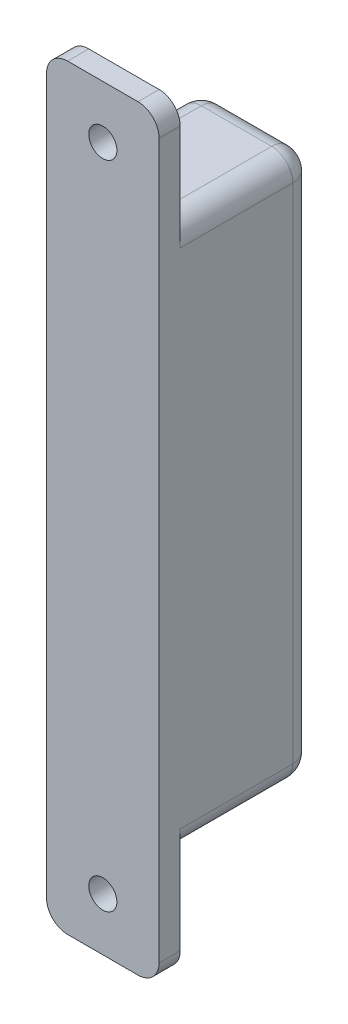
ISO-10303-21;
HEADER;
FILE_DESCRIPTION(('STEP AP214'),'2;1');
FILE_NAME('part.step','',(''),(''),'','','');
FILE_SCHEMA(('AUTOMOTIVE_DESIGN { 1 0 10303 214 1 1 1 1 }'));
ENDSEC;
DATA;
#1=APPLICATION_CONTEXT('core data for automotive mechanical design processes');
#2=APPLICATION_PROTOCOL_DEFINITION('international standard','automotive_design',2000,#1);
#3=PRODUCT_CONTEXT('',#1,'mechanical');
#4=PRODUCT('Part','Part','',(#3));
#5=PRODUCT_RELATED_PRODUCT_CATEGORY('part','',(#4));
#6=PRODUCT_DEFINITION_FORMATION('','',#4);
#7=PRODUCT_DEFINITION_CONTEXT('part definition',#1,'design');
#8=PRODUCT_DEFINITION('design','',#6,#7);
#9=PRODUCT_DEFINITION_SHAPE('','',#8);
#10=(LENGTH_UNIT() NAMED_UNIT(*) SI_UNIT(.MILLI.,.METRE.));
#11=(NAMED_UNIT(*) PLANE_ANGLE_UNIT() SI_UNIT($,.RADIAN.));
#12=(NAMED_UNIT(*) SI_UNIT($,.STERADIAN.) SOLID_ANGLE_UNIT());
#13=UNCERTAINTY_MEASURE_WITH_UNIT(LENGTH_MEASURE(1.E-05),#10,'distance_accuracy_value','');
#14=(GEOMETRIC_REPRESENTATION_CONTEXT(3) GLOBAL_UNCERTAINTY_ASSIGNED_CONTEXT((#13)) GLOBAL_UNIT_ASSIGNED_CONTEXT((#10,
#11,#12)) REPRESENTATION_CONTEXT('',''));
#15=CARTESIAN_POINT('',(0.,0.,0.));
#16=DIRECTION('',(0.,0.,1.));
#17=DIRECTION('',(1.,0.,0.));
#18=AXIS2_PLACEMENT_3D('',#15,#16,#17);
#19=CARTESIAN_POINT('',(0.,0.,3.));
#20=DIRECTION('',(0.,0.,-1.));
#21=DIRECTION('',(-1.,0.,0.));
#22=AXIS2_PLACEMENT_3D('',#19,#20,#21);
#23=PLANE('',#22);
#24=DIRECTION('',(0.,-1.,0.));
#25=VECTOR('',#24,1.);
#26=CARTESIAN_POINT('',(0.,-15.,3.));
#27=LINE('',#26,#25);
#28=CARTESIAN_POINT('',(0.,89.5,3.));
#29=VERTEX_POINT('',#28);
#30=CARTESIAN_POINT('',(0.,-12.,3.));
#31=VERTEX_POINT('',#30);
#32=EDGE_CURVE('E310',#29,#31,#27,.T.);
#33=ORIENTED_EDGE('',*,*,#32,.T.);
#34=CARTESIAN_POINT('',(3.,-12.,3.));
#35=DIRECTION('',(0.,0.,-1.));
#36=DIRECTION('',(-1.,0.,0.));
#37=AXIS2_PLACEMENT_3D('',#34,#35,#36);
#38=CIRCLE('',#37,3.);
#39=CARTESIAN_POINT('',(3.,-15.,3.));
#40=VERTEX_POINT('',#39);
#41=EDGE_CURVE('E284',#31,#40,#38,.F.);
#42=ORIENTED_EDGE('',*,*,#41,.T.);
#43=DIRECTION('',(1.,0.,0.));
#44=VECTOR('',#43,1.);
#45=CARTESIAN_POINT('',(16.,-15.,3.));
#46=LINE('',#45,#44);
#47=CARTESIAN_POINT('',(13.,-15.,3.));
#48=VERTEX_POINT('',#47);
#49=EDGE_CURVE('E320',#40,#48,#46,.T.);
#50=ORIENTED_EDGE('',*,*,#49,.T.);
#51=CARTESIAN_POINT('',(13.,-12.,3.));
#52=DIRECTION('',(0.,0.,-1.));
#53=DIRECTION('',(-1.,0.,0.));
#54=AXIS2_PLACEMENT_3D('',#51,#52,#53);
#55=CIRCLE('',#54,3.);
#56=CARTESIAN_POINT('',(16.,-12.,3.));
#57=VERTEX_POINT('',#56);
#58=EDGE_CURVE('E282',#48,#57,#55,.F.);
#59=ORIENTED_EDGE('',*,*,#58,.T.);
#60=DIRECTION('',(0.,1.,0.));
#61=VECTOR('',#60,1.);
#62=CARTESIAN_POINT('',(16.,0.,3.));
#63=LINE('',#62,#61);
#64=CARTESIAN_POINT('',(16.,89.5,3.));
#65=VERTEX_POINT('',#64);
#66=EDGE_CURVE('E315',#57,#65,#63,.T.);
#67=ORIENTED_EDGE('',*,*,#66,.T.);
#68=CARTESIAN_POINT('',(13.,89.5,3.));
#69=DIRECTION('',(0.,0.,-1.));
#70=DIRECTION('',(-1.,0.,0.));
#71=AXIS2_PLACEMENT_3D('',#68,#69,#70);
#72=CIRCLE('',#71,3.);
#73=CARTESIAN_POINT('',(13.,92.5,3.));
#74=VERTEX_POINT('',#73);
#75=EDGE_CURVE('E278',#65,#74,#72,.F.);
#76=ORIENTED_EDGE('',*,*,#75,.T.);
#77=DIRECTION('',(-1.,0.,0.));
#78=VECTOR('',#77,1.);
#79=CARTESIAN_POINT('',(0.,92.5,3.));
#80=LINE('',#79,#78);
#81=CARTESIAN_POINT('',(3.,92.5,3.));
#82=VERTEX_POINT('',#81);
#83=EDGE_CURVE('E298',#74,#82,#80,.T.);
#84=ORIENTED_EDGE('',*,*,#83,.T.);
#85=CARTESIAN_POINT('',(3.,89.5,3.));
#86=DIRECTION('',(0.,0.,-1.));
#87=DIRECTION('',(-1.,0.,0.));
#88=AXIS2_PLACEMENT_3D('',#85,#86,#87);
#89=CIRCLE('',#88,3.);
#90=EDGE_CURVE('E280',#82,#29,#89,.F.);
#91=ORIENTED_EDGE('',*,*,#90,.T.);
#92=EDGE_LOOP('',(#33,#42,#50,#59,#67,#76,#84,#91));
#93=FACE_BOUND('',#92,.T.);
#94=CARTESIAN_POINT('',(7.99999999999984,-7.49999999999999,3.));
#95=DIRECTION('',(0.,0.,-1.));
#96=DIRECTION('',(-1.,0.,0.));
#97=AXIS2_PLACEMENT_3D('',#94,#95,#96);
#98=CIRCLE('',#97,2.);
#99=CARTESIAN_POINT('',(5.99999999999985,-7.49999999999999,3.));
#100=VERTEX_POINT('',#99);
#101=EDGE_CURVE('E265',#100,#100,#98,.T.);
#102=ORIENTED_EDGE('',*,*,#101,.T.);
#103=EDGE_LOOP('',(#102));
#104=FACE_BOUND('',#103,.T.);
#105=CARTESIAN_POINT('',(8.,85.,3.));
#106=DIRECTION('',(0.,0.,1.));
#107=DIRECTION('',(1.,0.,0.));
#108=AXIS2_PLACEMENT_3D('',#105,#106,#107);
#109=CIRCLE('',#108,2.);
#110=CARTESIAN_POINT('',(10.,85.,3.));
#111=VERTEX_POINT('',#110);
#112=EDGE_CURVE('E334',#111,#111,#109,.T.);
#113=ORIENTED_EDGE('',*,*,#112,.F.);
#114=EDGE_LOOP('',(#113));
#115=FACE_BOUND('',#114,.T.);
#116=ADVANCED_FACE('F33',(#93,#104,#115),#23,.F.);
#117=CARTESIAN_POINT('',(16.,0.,-19.));
#118=DIRECTION('',(0.,-1.,0.));
#119=DIRECTION('',(0.,0.,-1.));
#120=AXIS2_PLACEMENT_3D('',#117,#118,#119);
#121=PLANE('',#120);
#122=DIRECTION('',(1.,0.,0.));
#123=VECTOR('',#122,1.);
#124=CARTESIAN_POINT('',(16.,0.,0.));
#125=LINE('',#124,#123);
#126=CARTESIAN_POINT('',(3.,0.,0.));
#127=VERTEX_POINT('',#126);
#128=CARTESIAN_POINT('',(13.,0.,0.));
#129=VERTEX_POINT('',#128);
#130=EDGE_CURVE('E198',#127,#129,#125,.T.);
#131=ORIENTED_EDGE('',*,*,#130,.F.);
#132=DIRECTION('',(0.,0.,1.));
#133=VECTOR('',#132,1.);
#134=CARTESIAN_POINT('',(3.,0.,-19.));
#135=LINE('',#134,#133);
#136=CARTESIAN_POINT('',(3.,0.,-16.));
#137=VERTEX_POINT('',#136);
#138=EDGE_CURVE('E208',#127,#137,#135,.F.);
#139=ORIENTED_EDGE('',*,*,#138,.T.);
#140=DIRECTION('',(1.,0.,0.));
#141=VECTOR('',#140,1.);
#142=CARTESIAN_POINT('',(16.,0.,-16.));
#143=LINE('',#142,#141);
#144=CARTESIAN_POINT('',(13.,0.,-16.));
#145=VERTEX_POINT('',#144);
#146=EDGE_CURVE('E204',#137,#145,#143,.T.);
#147=ORIENTED_EDGE('',*,*,#146,.T.);
#148=DIRECTION('',(0.,0.,1.));
#149=VECTOR('',#148,1.);
#150=CARTESIAN_POINT('',(13.,0.,-19.));
#151=LINE('',#150,#149);
#152=EDGE_CURVE('E206',#145,#129,#151,.T.);
#153=ORIENTED_EDGE('',*,*,#152,.T.);
#154=EDGE_LOOP('',(#131,#139,#147,#153));
#155=FACE_BOUND('',#154,.T.);
#156=ADVANCED_FACE('F382',(#155),#121,.T.);
#157=CARTESIAN_POINT('',(0.,0.,-19.));
#158=DIRECTION('',(-1.,0.,0.));
#159=DIRECTION('',(0.,0.,1.));
#160=AXIS2_PLACEMENT_3D('',#157,#158,#159);
#161=PLANE('',#160);
#162=DIRECTION('',(0.,-1.,0.));
#163=VECTOR('',#162,1.);
#164=CARTESIAN_POINT('',(0.,77.5,0.));
#165=LINE('',#164,#163);
#166=CARTESIAN_POINT('',(0.,3.,0.));
#167=VERTEX_POINT('',#166);
#168=CARTESIAN_POINT('',(0.,-12.,0.));
#169=VERTEX_POINT('',#168);
#170=EDGE_CURVE('E302',#167,#169,#165,.T.);
#171=ORIENTED_EDGE('',*,*,#170,.T.);
#172=DIRECTION('',(0.,0.,-1.));
#173=VECTOR('',#172,1.);
#174=CARTESIAN_POINT('',(0.,-12.,3.));
#175=LINE('',#174,#173);
#176=EDGE_CURVE('E276',#169,#31,#175,.F.);
#177=ORIENTED_EDGE('',*,*,#176,.T.);
#178=ORIENTED_EDGE('',*,*,#32,.F.);
#179=DIRECTION('',(0.,0.,-1.));
#180=VECTOR('',#179,1.);
#181=CARTESIAN_POINT('',(0.,89.5,0.));
#182=LINE('',#181,#180);
#183=CARTESIAN_POINT('',(0.,89.5,0.));
#184=VERTEX_POINT('',#183);
#185=EDGE_CURVE('E274',#29,#184,#182,.T.);
#186=ORIENTED_EDGE('',*,*,#185,.T.);
#187=CARTESIAN_POINT('',(0.,74.5,0.));
#188=VERTEX_POINT('',#187);
#189=EDGE_CURVE('E167',#184,#188,#165,.T.);
#190=ORIENTED_EDGE('',*,*,#189,.T.);
#191=DIRECTION('',(0.,0.,1.));
#192=VECTOR('',#191,1.);
#193=CARTESIAN_POINT('',(0.,74.5,-19.));
#194=LINE('',#193,#192);
#195=CARTESIAN_POINT('',(0.,74.5,-16.));
#196=VERTEX_POINT('',#195);
#197=EDGE_CURVE('E158',#188,#196,#194,.F.);
#198=ORIENTED_EDGE('',*,*,#197,.T.);
#199=DIRECTION('',(0.,-1.,0.));
#200=VECTOR('',#199,1.);
#201=CARTESIAN_POINT('',(0.,0.,-16.));
#202=LINE('',#201,#200);
#203=CARTESIAN_POINT('',(0.,3.,-16.));
#204=VERTEX_POINT('',#203);
#205=EDGE_CURVE('E164',#196,#204,#202,.T.);
#206=ORIENTED_EDGE('',*,*,#205,.T.);
#207=DIRECTION('',(0.,0.,1.));
#208=VECTOR('',#207,1.);
#209=CARTESIAN_POINT('',(0.,3.,-19.));
#210=LINE('',#209,#208);
#211=EDGE_CURVE('E171',#204,#167,#210,.T.);
#212=ORIENTED_EDGE('',*,*,#211,.T.);
#213=EDGE_LOOP('',(#171,#177,#178,#186,#190,#198,#206,#212));
#214=FACE_BOUND('',#213,.T.);
#215=ADVANCED_FACE('F161',(#214),#161,.T.);
#216=CARTESIAN_POINT('',(0.,77.5,-19.));
#217=DIRECTION('',(0.,1.,0.));
#218=DIRECTION('',(0.,0.,1.));
#219=AXIS2_PLACEMENT_3D('',#216,#217,#218);
#220=PLANE('',#219);
#221=DIRECTION('',(-1.,0.,0.));
#222=VECTOR('',#221,1.);
#223=CARTESIAN_POINT('',(0.,77.5,0.));
#224=LINE('',#223,#222);
#225=CARTESIAN_POINT('',(13.,77.5,0.));
#226=VERTEX_POINT('',#225);
#227=CARTESIAN_POINT('',(3.,77.5,0.));
#228=VERTEX_POINT('',#227);
#229=EDGE_CURVE('E195',#226,#228,#224,.T.);
#230=ORIENTED_EDGE('',*,*,#229,.F.);
#231=DIRECTION('',(0.,0.,1.));
#232=VECTOR('',#231,1.);
#233=CARTESIAN_POINT('',(13.,77.5,-19.));
#234=LINE('',#233,#232);
#235=CARTESIAN_POINT('',(13.,77.5,-16.));
#236=VERTEX_POINT('',#235);
#237=EDGE_CURVE('E220',#226,#236,#234,.F.);
#238=ORIENTED_EDGE('',*,*,#237,.T.);
#239=DIRECTION('',(-1.,0.,0.));
#240=VECTOR('',#239,1.);
#241=CARTESIAN_POINT('',(0.,77.5,-16.));
#242=LINE('',#241,#240);
#243=CARTESIAN_POINT('',(3.,77.5,-16.));
#244=VERTEX_POINT('',#243);
#245=EDGE_CURVE('E217',#236,#244,#242,.T.);
#246=ORIENTED_EDGE('',*,*,#245,.T.);
#247=DIRECTION('',(0.,0.,1.));
#248=VECTOR('',#247,1.);
#249=CARTESIAN_POINT('',(3.,77.5,-19.));
#250=LINE('',#249,#248);
#251=EDGE_CURVE('E178',#244,#228,#250,.T.);
#252=ORIENTED_EDGE('',*,*,#251,.T.);
#253=EDGE_LOOP('',(#230,#238,#246,#252));
#254=FACE_BOUND('',#253,.T.);
#255=ADVANCED_FACE('F409',(#254),#220,.T.);
#256=CARTESIAN_POINT('',(16.,77.5,-19.));
#257=DIRECTION('',(1.,0.,0.));
#258=DIRECTION('',(0.,0.,-1.));
#259=AXIS2_PLACEMENT_3D('',#256,#257,#258);
#260=PLANE('',#259);
#261=ORIENTED_EDGE('',*,*,#66,.F.);
#262=DIRECTION('',(0.,0.,-1.));
#263=VECTOR('',#262,1.);
#264=CARTESIAN_POINT('',(16.,-12.,0.));
#265=LINE('',#264,#263);
#266=CARTESIAN_POINT('',(16.,-12.,0.));
#267=VERTEX_POINT('',#266);
#268=EDGE_CURVE('E288',#57,#267,#265,.T.);
#269=ORIENTED_EDGE('',*,*,#268,.T.);
#270=DIRECTION('',(0.,1.,0.));
#271=VECTOR('',#270,1.);
#272=CARTESIAN_POINT('',(16.,92.5,0.));
#273=LINE('',#272,#271);
#274=CARTESIAN_POINT('',(16.,3.,0.));
#275=VERTEX_POINT('',#274);
#276=EDGE_CURVE('E303',#267,#275,#273,.T.);
#277=ORIENTED_EDGE('',*,*,#276,.T.);
#278=DIRECTION('',(0.,0.,1.));
#279=VECTOR('',#278,1.);
#280=CARTESIAN_POINT('',(16.,3.,-19.));
#281=LINE('',#280,#279);
#282=CARTESIAN_POINT('',(16.,3.,-16.));
#283=VERTEX_POINT('',#282);
#284=EDGE_CURVE('E215',#275,#283,#281,.F.);
#285=ORIENTED_EDGE('',*,*,#284,.T.);
#286=DIRECTION('',(0.,1.,0.));
#287=VECTOR('',#286,1.);
#288=CARTESIAN_POINT('',(16.,77.5,-16.));
#289=LINE('',#288,#287);
#290=CARTESIAN_POINT('',(16.,74.5,-16.));
#291=VERTEX_POINT('',#290);
#292=EDGE_CURVE('E210',#283,#291,#289,.T.);
#293=ORIENTED_EDGE('',*,*,#292,.T.);
#294=DIRECTION('',(0.,0.,1.));
#295=VECTOR('',#294,1.);
#296=CARTESIAN_POINT('',(16.,74.5,-19.));
#297=LINE('',#296,#295);
#298=CARTESIAN_POINT('',(16.,74.5,0.));
#299=VERTEX_POINT('',#298);
#300=EDGE_CURVE('E212',#291,#299,#297,.T.);
#301=ORIENTED_EDGE('',*,*,#300,.T.);
#302=CARTESIAN_POINT('',(16.,89.5,0.));
#303=VERTEX_POINT('',#302);
#304=EDGE_CURVE('E306',#299,#303,#273,.T.);
#305=ORIENTED_EDGE('',*,*,#304,.T.);
#306=DIRECTION('',(0.,0.,-1.));
#307=VECTOR('',#306,1.);
#308=CARTESIAN_POINT('',(16.,89.5,3.));
#309=LINE('',#308,#307);
#310=EDGE_CURVE('E286',#303,#65,#309,.F.);
#311=ORIENTED_EDGE('',*,*,#310,.T.);
#312=EDGE_LOOP('',(#261,#269,#277,#285,#293,#301,#305,#311));
#313=FACE_BOUND('',#312,.T.);
#314=ADVANCED_FACE('F351',(#313),#260,.T.);
#315=CARTESIAN_POINT('',(0.,0.,-19.));
#316=DIRECTION('',(0.,0.,-1.));
#317=DIRECTION('',(-1.,0.,0.));
#318=AXIS2_PLACEMENT_3D('',#315,#316,#317);
#319=PLANE('',#318);
#320=DIRECTION('',(-1.,0.,0.));
#321=VECTOR('',#320,1.);
#322=CARTESIAN_POINT('',(0.,74.5,-19.));
#323=LINE('',#322,#321);
#324=CARTESIAN_POINT('',(3.,74.5,-19.));
#325=VERTEX_POINT('',#324);
#326=CARTESIAN_POINT('',(13.,74.5,-19.));
#327=VERTEX_POINT('',#326);
#328=EDGE_CURVE('E224',#325,#327,#323,.F.);
#329=ORIENTED_EDGE('',*,*,#328,.T.);
#330=DIRECTION('',(0.,1.,0.));
#331=VECTOR('',#330,1.);
#332=CARTESIAN_POINT('',(13.,0.,-19.));
#333=LINE('',#332,#331);
#334=CARTESIAN_POINT('',(13.,3.,-19.));
#335=VERTEX_POINT('',#334);
#336=EDGE_CURVE('E229',#327,#335,#333,.F.);
#337=ORIENTED_EDGE('',*,*,#336,.T.);
#338=DIRECTION('',(1.,0.,0.));
#339=VECTOR('',#338,1.);
#340=CARTESIAN_POINT('',(0.,3.,-19.));
#341=LINE('',#340,#339);
#342=CARTESIAN_POINT('',(3.,3.,-19.));
#343=VERTEX_POINT('',#342);
#344=EDGE_CURVE('E226',#335,#343,#341,.F.);
#345=ORIENTED_EDGE('',*,*,#344,.T.);
#346=DIRECTION('',(0.,-1.,0.));
#347=VECTOR('',#346,1.);
#348=CARTESIAN_POINT('',(3.,0.,-19.));
#349=LINE('',#348,#347);
#350=EDGE_CURVE('E222',#343,#325,#349,.F.);
#351=ORIENTED_EDGE('',*,*,#350,.T.);
#352=EDGE_LOOP('',(#329,#337,#345,#351));
#353=FACE_BOUND('',#352,.T.);
#354=ADVANCED_FACE('F404',(#353),#319,.T.);
#355=CARTESIAN_POINT('',(0.,0.,0.));
#356=DIRECTION('',(0.,0.,-1.));
#357=DIRECTION('',(-1.,0.,0.));
#358=AXIS2_PLACEMENT_3D('',#355,#356,#357);
#359=PLANE('',#358);
#360=CARTESIAN_POINT('',(7.99999999999984,-7.49999999999999,0.));
#361=DIRECTION('',(0.,0.,-1.));
#362=DIRECTION('',(-1.,0.,0.));
#363=AXIS2_PLACEMENT_3D('',#360,#361,#362);
#364=CIRCLE('',#363,2.);
#365=CARTESIAN_POINT('',(5.99999999999985,-7.49999999999999,0.));
#366=VERTEX_POINT('',#365);
#367=EDGE_CURVE('E325',#366,#366,#364,.F.);
#368=ORIENTED_EDGE('',*,*,#367,.T.);
#369=EDGE_LOOP('',(#368));
#370=FACE_BOUND('',#369,.T.);
#371=DIRECTION('',(1.,0.,0.));
#372=VECTOR('',#371,1.);
#373=CARTESIAN_POINT('',(16.,-15.,0.));
#374=LINE('',#373,#372);
#375=CARTESIAN_POINT('',(3.,-15.,0.));
#376=VERTEX_POINT('',#375);
#377=CARTESIAN_POINT('',(13.,-15.,0.));
#378=VERTEX_POINT('',#377);
#379=EDGE_CURVE('E323',#376,#378,#374,.T.);
#380=ORIENTED_EDGE('',*,*,#379,.F.);
#381=CARTESIAN_POINT('',(3.,-12.,0.));
#382=DIRECTION('',(0.,0.,-1.));
#383=DIRECTION('',(-1.,0.,0.));
#384=AXIS2_PLACEMENT_3D('',#381,#382,#383);
#385=CIRCLE('',#384,3.);
#386=EDGE_CURVE('E272',#376,#169,#385,.T.);
#387=ORIENTED_EDGE('',*,*,#386,.T.);
#388=ORIENTED_EDGE('',*,*,#170,.F.);
#389=CARTESIAN_POINT('',(3.,3.,0.));
#390=DIRECTION('',(0.,0.,-1.));
#391=DIRECTION('',(-1.,0.,0.));
#392=AXIS2_PLACEMENT_3D('',#389,#390,#391);
#393=CIRCLE('',#392,3.);
#394=EDGE_CURVE('E231',#167,#127,#393,.F.);
#395=ORIENTED_EDGE('',*,*,#394,.T.);
#396=ORIENTED_EDGE('',*,*,#130,.T.);
#397=CARTESIAN_POINT('',(13.,3.,0.));
#398=DIRECTION('',(0.,0.,-1.));
#399=DIRECTION('',(-1.,0.,0.));
#400=AXIS2_PLACEMENT_3D('',#397,#398,#399);
#401=CIRCLE('',#400,3.);
#402=EDGE_CURVE('E233',#129,#275,#401,.F.);
#403=ORIENTED_EDGE('',*,*,#402,.T.);
#404=ORIENTED_EDGE('',*,*,#276,.F.);
#405=CARTESIAN_POINT('',(13.,-12.,0.));
#406=DIRECTION('',(0.,0.,-1.));
#407=DIRECTION('',(-1.,0.,0.));
#408=AXIS2_PLACEMENT_3D('',#405,#406,#407);
#409=CIRCLE('',#408,3.);
#410=EDGE_CURVE('E270',#267,#378,#409,.T.);
#411=ORIENTED_EDGE('',*,*,#410,.T.);
#412=EDGE_LOOP('',(#380,#387,#388,#395,#396,#403,#404,#411));
#413=FACE_BOUND('',#412,.T.);
#414=ADVANCED_FACE('F352',(#370,#413),#359,.T.);
#415=CARTESIAN_POINT('',(16.,-15.,3.));
#416=DIRECTION('',(0.,1.,0.));
#417=DIRECTION('',(0.,0.,1.));
#418=AXIS2_PLACEMENT_3D('',#415,#416,#417);
#419=PLANE('',#418);
#420=ORIENTED_EDGE('',*,*,#49,.F.);
#421=DIRECTION('',(0.,0.,-1.));
#422=VECTOR('',#421,1.);
#423=CARTESIAN_POINT('',(3.,-15.,0.));
#424=LINE('',#423,#422);
#425=EDGE_CURVE('E267',#40,#376,#424,.T.);
#426=ORIENTED_EDGE('',*,*,#425,.T.);
#427=ORIENTED_EDGE('',*,*,#379,.T.);
#428=DIRECTION('',(0.,0.,-1.));
#429=VECTOR('',#428,1.);
#430=CARTESIAN_POINT('',(13.,-15.,3.));
#431=LINE('',#430,#429);
#432=EDGE_CURVE('E240',#378,#48,#431,.F.);
#433=ORIENTED_EDGE('',*,*,#432,.T.);
#434=EDGE_LOOP('',(#420,#426,#427,#433));
#435=FACE_BOUND('',#434,.T.);
#436=ADVANCED_FACE('F401',(#435),#419,.F.);
#437=CARTESIAN_POINT('',(0.,92.5,3.));
#438=DIRECTION('',(0.,-1.,0.));
#439=DIRECTION('',(0.,0.,-1.));
#440=AXIS2_PLACEMENT_3D('',#437,#438,#439);
#441=PLANE('',#440);
#442=DIRECTION('',(-1.,0.,0.));
#443=VECTOR('',#442,1.);
#444=CARTESIAN_POINT('',(0.,92.5,0.));
#445=LINE('',#444,#443);
#446=CARTESIAN_POINT('',(13.,92.5,0.));
#447=VERTEX_POINT('',#446);
#448=CARTESIAN_POINT('',(3.,92.5,0.));
#449=VERTEX_POINT('',#448);
#450=EDGE_CURVE('E295',#447,#449,#445,.T.);
#451=ORIENTED_EDGE('',*,*,#450,.T.);
#452=DIRECTION('',(0.,0.,-1.));
#453=VECTOR('',#452,1.);
#454=CARTESIAN_POINT('',(3.,92.5,3.));
#455=LINE('',#454,#453);
#456=EDGE_CURVE('E11',#449,#82,#455,.F.);
#457=ORIENTED_EDGE('',*,*,#456,.T.);
#458=ORIENTED_EDGE('',*,*,#83,.F.);
#459=DIRECTION('',(0.,0.,-1.));
#460=VECTOR('',#459,1.);
#461=CARTESIAN_POINT('',(13.,92.5,0.));
#462=LINE('',#461,#460);
#463=EDGE_CURVE('E41',#74,#447,#462,.T.);
#464=ORIENTED_EDGE('',*,*,#463,.T.);
#465=EDGE_LOOP('',(#451,#457,#458,#464));
#466=FACE_BOUND('',#465,.T.);
#467=ADVANCED_FACE('F294',(#466),#441,.F.);
#468=CARTESIAN_POINT('',(8.,85.,0.));
#469=DIRECTION('',(0.,0.,-1.));
#470=DIRECTION('',(-1.,0.,0.));
#471=AXIS2_PLACEMENT_3D('',#468,#469,#470);
#472=CIRCLE('',#471,2.);
#473=CARTESIAN_POINT('',(6.,85.,0.));
#474=VERTEX_POINT('',#473);
#475=EDGE_CURVE('E201',#474,#474,#472,.T.);
#476=ORIENTED_EDGE('',*,*,#475,.F.);
#477=EDGE_LOOP('',(#476));
#478=FACE_BOUND('',#477,.T.);
#479=ORIENTED_EDGE('',*,*,#189,.F.);
#480=CARTESIAN_POINT('',(3.,89.5,0.));
#481=DIRECTION('',(0.,0.,-1.));
#482=DIRECTION('',(-1.,0.,0.));
#483=AXIS2_PLACEMENT_3D('',#480,#481,#482);
#484=CIRCLE('',#483,3.);
#485=EDGE_CURVE('E48',#184,#449,#484,.T.);
#486=ORIENTED_EDGE('',*,*,#485,.T.);
#487=ORIENTED_EDGE('',*,*,#450,.F.);
#488=CARTESIAN_POINT('',(13.,89.5,0.));
#489=DIRECTION('',(0.,0.,-1.));
#490=DIRECTION('',(-1.,0.,0.));
#491=AXIS2_PLACEMENT_3D('',#488,#489,#490);
#492=CIRCLE('',#491,3.);
#493=EDGE_CURVE('E56',#447,#303,#492,.T.);
#494=ORIENTED_EDGE('',*,*,#493,.T.);
#495=ORIENTED_EDGE('',*,*,#304,.F.);
#496=CARTESIAN_POINT('',(13.,74.5,0.));
#497=DIRECTION('',(0.,0.,-1.));
#498=DIRECTION('',(-1.,0.,0.));
#499=AXIS2_PLACEMENT_3D('',#496,#497,#498);
#500=CIRCLE('',#499,3.);
#501=EDGE_CURVE('E236',#299,#226,#500,.F.);
#502=ORIENTED_EDGE('',*,*,#501,.T.);
#503=ORIENTED_EDGE('',*,*,#229,.T.);
#504=CARTESIAN_POINT('',(3.,74.5,0.));
#505=DIRECTION('',(0.,0.,-1.));
#506=DIRECTION('',(-1.,0.,0.));
#507=AXIS2_PLACEMENT_3D('',#504,#505,#506);
#508=CIRCLE('',#507,3.);
#509=EDGE_CURVE('E238',#228,#188,#508,.F.);
#510=ORIENTED_EDGE('',*,*,#509,.T.);
#511=EDGE_LOOP('',(#479,#486,#487,#494,#495,#502,#503,#510));
#512=FACE_BOUND('',#511,.T.);
#513=ADVANCED_FACE('F300',(#478,#512),#359,.T.);
#514=CARTESIAN_POINT('',(8.,85.,-19.));
#515=DIRECTION('',(0.,0.,1.));
#516=DIRECTION('',(1.,0.,0.));
#517=AXIS2_PLACEMENT_3D('',#514,#515,#516);
#518=CYLINDRICAL_SURFACE('',#517,2.);
#519=ORIENTED_EDGE('',*,*,#475,.T.);
#520=EDGE_LOOP('',(#519));
#521=FACE_BOUND('',#520,.T.);
#522=ORIENTED_EDGE('',*,*,#112,.T.);
#523=EDGE_LOOP('',(#522));
#524=FACE_BOUND('',#523,.T.);
#525=ADVANCED_FACE('F397',(#521,#524),#518,.F.);
#526=CARTESIAN_POINT('',(7.99999999999984,-7.49999999999999,-19.));
#527=DIRECTION('',(0.,0.,1.));
#528=DIRECTION('',(1.,0.,0.));
#529=AXIS2_PLACEMENT_3D('',#526,#527,#528);
#530=CYLINDRICAL_SURFACE('',#529,2.);
#531=ORIENTED_EDGE('',*,*,#367,.F.);
#532=EDGE_LOOP('',(#531));
#533=FACE_BOUND('',#532,.T.);
#534=ORIENTED_EDGE('',*,*,#101,.F.);
#535=EDGE_LOOP('',(#534));
#536=FACE_BOUND('',#535,.T.);
#537=ADVANCED_FACE('F393',(#533,#536),#530,.F.);
#538=CARTESIAN_POINT('',(13.,74.5,-19.));
#539=DIRECTION('',(0.,0.,1.));
#540=DIRECTION('',(1.,0.,0.));
#541=AXIS2_PLACEMENT_3D('',#538,#539,#540);
#542=CYLINDRICAL_SURFACE('',#541,3.);
#543=CARTESIAN_POINT('',(13.,74.5,-16.));
#544=DIRECTION('',(0.,0.,-1.));
#545=DIRECTION('',(-1.,0.,0.));
#546=AXIS2_PLACEMENT_3D('',#543,#544,#545);
#547=CIRCLE('',#546,3.);
#548=EDGE_CURVE('E262',#236,#291,#547,.T.);
#549=ORIENTED_EDGE('',*,*,#548,.F.);
#550=ORIENTED_EDGE('',*,*,#237,.F.);
#551=ORIENTED_EDGE('',*,*,#501,.F.);
#552=ORIENTED_EDGE('',*,*,#300,.F.);
#553=EDGE_LOOP('',(#549,#550,#551,#552));
#554=FACE_BOUND('',#553,.T.);
#555=ADVANCED_FACE('F373',(#554),#542,.T.);
#556=CARTESIAN_POINT('',(13.,74.5,-16.));
#557=DIRECTION('',(0.,0.,1.));
#558=DIRECTION('',(1.,0.,0.));
#559=AXIS2_PLACEMENT_3D('',#556,#557,#558);
#560=SPHERICAL_SURFACE('',#559,3.);
#561=CARTESIAN_POINT('',(13.,74.5,-16.));
#562=DIRECTION('',(1.,0.,0.));
#563=DIRECTION('',(0.,0.,-1.));
#564=AXIS2_PLACEMENT_3D('',#561,#562,#563);
#565=CIRCLE('',#564,3.);
#566=EDGE_CURVE('E256',#236,#327,#565,.F.);
#567=ORIENTED_EDGE('',*,*,#566,.F.);
#568=ORIENTED_EDGE('',*,*,#548,.T.);
#569=CARTESIAN_POINT('',(13.,74.5,-16.));
#570=DIRECTION('',(0.,1.,0.));
#571=DIRECTION('',(0.,0.,1.));
#572=AXIS2_PLACEMENT_3D('',#569,#570,#571);
#573=CIRCLE('',#572,3.);
#574=EDGE_CURVE('E259',#327,#291,#573,.F.);
#575=ORIENTED_EDGE('',*,*,#574,.F.);
#576=EDGE_LOOP('',(#567,#568,#575));
#577=FACE_BOUND('',#576,.T.);
#578=ADVANCED_FACE('F368',(#577),#560,.T.);
#579=CARTESIAN_POINT('',(13.,3.,-19.));
#580=DIRECTION('',(0.,0.,1.));
#581=DIRECTION('',(1.,0.,0.));
#582=AXIS2_PLACEMENT_3D('',#579,#580,#581);
#583=CYLINDRICAL_SURFACE('',#582,3.);
#584=ORIENTED_EDGE('',*,*,#402,.F.);
#585=ORIENTED_EDGE('',*,*,#152,.F.);
#586=CARTESIAN_POINT('',(13.,3.,-16.));
#587=DIRECTION('',(0.,0.,-1.));
#588=DIRECTION('',(-1.,0.,0.));
#589=AXIS2_PLACEMENT_3D('',#586,#587,#588);
#590=CIRCLE('',#589,3.);
#591=EDGE_CURVE('E253',#283,#145,#590,.T.);
#592=ORIENTED_EDGE('',*,*,#591,.F.);
#593=ORIENTED_EDGE('',*,*,#284,.F.);
#594=EDGE_LOOP('',(#584,#585,#592,#593));
#595=FACE_BOUND('',#594,.T.);
#596=ADVANCED_FACE('F357',(#595),#583,.T.);
#597=CARTESIAN_POINT('',(13.,77.5,-16.));
#598=DIRECTION('',(0.,1.,0.));
#599=DIRECTION('',(0.,0.,1.));
#600=AXIS2_PLACEMENT_3D('',#597,#598,#599);
#601=CYLINDRICAL_SURFACE('',#600,3.);
#602=ORIENTED_EDGE('',*,*,#574,.T.);
#603=ORIENTED_EDGE('',*,*,#292,.F.);
#604=CARTESIAN_POINT('',(13.,3.,-16.));
#605=DIRECTION('',(0.,-1.,0.));
#606=DIRECTION('',(0.,0.,-1.));
#607=AXIS2_PLACEMENT_3D('',#604,#605,#606);
#608=CIRCLE('',#607,3.);
#609=EDGE_CURVE('E250',#335,#283,#608,.T.);
#610=ORIENTED_EDGE('',*,*,#609,.F.);
#611=ORIENTED_EDGE('',*,*,#336,.F.);
#612=EDGE_LOOP('',(#602,#603,#610,#611));
#613=FACE_BOUND('',#612,.T.);
#614=ADVANCED_FACE('F362',(#613),#601,.T.);
#615=CARTESIAN_POINT('',(0.,74.5,-16.));
#616=DIRECTION('',(-1.,0.,0.));
#617=DIRECTION('',(0.,0.,1.));
#618=AXIS2_PLACEMENT_3D('',#615,#616,#617);
#619=CYLINDRICAL_SURFACE('',#618,3.);
#620=ORIENTED_EDGE('',*,*,#566,.T.);
#621=ORIENTED_EDGE('',*,*,#328,.F.);
#622=CARTESIAN_POINT('',(3.,74.5,-16.));
#623=DIRECTION('',(-1.,0.,0.));
#624=DIRECTION('',(0.,0.,1.));
#625=AXIS2_PLACEMENT_3D('',#622,#623,#624);
#626=CIRCLE('',#625,3.);
#627=EDGE_CURVE('E182',#244,#325,#626,.T.);
#628=ORIENTED_EDGE('',*,*,#627,.F.);
#629=ORIENTED_EDGE('',*,*,#245,.F.);
#630=EDGE_LOOP('',(#620,#621,#628,#629));
#631=FACE_BOUND('',#630,.T.);
#632=ADVANCED_FACE('F438',(#631),#619,.T.);
#633=CARTESIAN_POINT('',(3.,74.5,-19.));
#634=DIRECTION('',(0.,0.,1.));
#635=DIRECTION('',(1.,0.,0.));
#636=AXIS2_PLACEMENT_3D('',#633,#634,#635);
#637=CYLINDRICAL_SURFACE('',#636,3.);
#638=ORIENTED_EDGE('',*,*,#509,.F.);
#639=ORIENTED_EDGE('',*,*,#251,.F.);
#640=CARTESIAN_POINT('',(3.,74.5,-16.));
#641=DIRECTION('',(0.,0.,-1.));
#642=DIRECTION('',(-1.,0.,0.));
#643=AXIS2_PLACEMENT_3D('',#640,#641,#642);
#644=CIRCLE('',#643,3.);
#645=EDGE_CURVE('E175',#196,#244,#644,.T.);
#646=ORIENTED_EDGE('',*,*,#645,.F.);
#647=ORIENTED_EDGE('',*,*,#197,.F.);
#648=EDGE_LOOP('',(#638,#639,#646,#647));
#649=FACE_BOUND('',#648,.T.);
#650=ADVANCED_FACE('F177',(#649),#637,.T.);
#651=CARTESIAN_POINT('',(13.,3.,-16.));
#652=DIRECTION('',(0.,0.,1.));
#653=DIRECTION('',(1.,0.,0.));
#654=AXIS2_PLACEMENT_3D('',#651,#652,#653);
#655=SPHERICAL_SURFACE('',#654,3.);
#656=ORIENTED_EDGE('',*,*,#609,.T.);
#657=ORIENTED_EDGE('',*,*,#591,.T.);
#658=CARTESIAN_POINT('',(13.,3.,-16.));
#659=DIRECTION('',(1.,0.,0.));
#660=DIRECTION('',(0.,0.,-1.));
#661=AXIS2_PLACEMENT_3D('',#658,#659,#660);
#662=CIRCLE('',#661,3.);
#663=EDGE_CURVE('E183',#335,#145,#662,.F.);
#664=ORIENTED_EDGE('',*,*,#663,.F.);
#665=EDGE_LOOP('',(#656,#657,#664));
#666=FACE_BOUND('',#665,.T.);
#667=ADVANCED_FACE('F432',(#666),#655,.T.);
#668=CARTESIAN_POINT('',(3.,74.5,-16.));
#669=DIRECTION('',(0.,0.,1.));
#670=DIRECTION('',(1.,0.,0.));
#671=AXIS2_PLACEMENT_3D('',#668,#669,#670);
#672=SPHERICAL_SURFACE('',#671,3.);
#673=ORIENTED_EDGE('',*,*,#645,.T.);
#674=ORIENTED_EDGE('',*,*,#627,.T.);
#675=CARTESIAN_POINT('',(3.,74.5,-16.));
#676=DIRECTION('',(0.,1.,0.));
#677=DIRECTION('',(0.,0.,1.));
#678=AXIS2_PLACEMENT_3D('',#675,#676,#677);
#679=CIRCLE('',#678,3.);
#680=EDGE_CURVE('E186',#196,#325,#679,.F.);
#681=ORIENTED_EDGE('',*,*,#680,.F.);
#682=EDGE_LOOP('',(#673,#674,#681));
#683=FACE_BOUND('',#682,.T.);
#684=ADVANCED_FACE('F187',(#683),#672,.T.);
#685=CARTESIAN_POINT('',(16.,3.,-16.));
#686=DIRECTION('',(1.,0.,0.));
#687=DIRECTION('',(0.,0.,-1.));
#688=AXIS2_PLACEMENT_3D('',#685,#686,#687);
#689=CYLINDRICAL_SURFACE('',#688,3.);
#690=ORIENTED_EDGE('',*,*,#663,.T.);
#691=ORIENTED_EDGE('',*,*,#146,.F.);
#692=CARTESIAN_POINT('',(3.,3.,-16.));
#693=DIRECTION('',(-1.,0.,0.));
#694=DIRECTION('',(0.,0.,1.));
#695=AXIS2_PLACEMENT_3D('',#692,#693,#694);
#696=CIRCLE('',#695,3.);
#697=EDGE_CURVE('E190',#343,#137,#696,.T.);
#698=ORIENTED_EDGE('',*,*,#697,.F.);
#699=ORIENTED_EDGE('',*,*,#344,.F.);
#700=EDGE_LOOP('',(#690,#691,#698,#699));
#701=FACE_BOUND('',#700,.T.);
#702=ADVANCED_FACE('F426',(#701),#689,.T.);
#703=CARTESIAN_POINT('',(3.,0.,-16.));
#704=DIRECTION('',(0.,-1.,0.));
#705=DIRECTION('',(0.,0.,-1.));
#706=AXIS2_PLACEMENT_3D('',#703,#704,#705);
#707=CYLINDRICAL_SURFACE('',#706,3.);
#708=ORIENTED_EDGE('',*,*,#680,.T.);
#709=ORIENTED_EDGE('',*,*,#350,.F.);
#710=CARTESIAN_POINT('',(3.,3.,-16.));
#711=DIRECTION('',(0.,-1.,0.));
#712=DIRECTION('',(0.,0.,-1.));
#713=AXIS2_PLACEMENT_3D('',#710,#711,#712);
#714=CIRCLE('',#713,3.);
#715=EDGE_CURVE('E193',#204,#343,#714,.T.);
#716=ORIENTED_EDGE('',*,*,#715,.F.);
#717=ORIENTED_EDGE('',*,*,#205,.F.);
#718=EDGE_LOOP('',(#708,#709,#716,#717));
#719=FACE_BOUND('',#718,.T.);
#720=ADVANCED_FACE('F192',(#719),#707,.T.);
#721=CARTESIAN_POINT('',(3.,3.,-16.));
#722=DIRECTION('',(0.,0.,1.));
#723=DIRECTION('',(1.,0.,0.));
#724=AXIS2_PLACEMENT_3D('',#721,#722,#723);
#725=SPHERICAL_SURFACE('',#724,3.);
#726=ORIENTED_EDGE('',*,*,#715,.T.);
#727=ORIENTED_EDGE('',*,*,#697,.T.);
#728=CARTESIAN_POINT('',(3.,3.,-16.));
#729=DIRECTION('',(0.,0.,-1.));
#730=DIRECTION('',(-1.,0.,0.));
#731=AXIS2_PLACEMENT_3D('',#728,#729,#730);
#732=CIRCLE('',#731,3.);
#733=EDGE_CURVE('E241',#204,#137,#732,.F.);
#734=ORIENTED_EDGE('',*,*,#733,.F.);
#735=EDGE_LOOP('',(#726,#727,#734));
#736=FACE_BOUND('',#735,.T.);
#737=ADVANCED_FACE('F419',(#736),#725,.T.);
#738=CARTESIAN_POINT('',(3.,3.,-19.));
#739=DIRECTION('',(0.,0.,1.));
#740=DIRECTION('',(1.,0.,0.));
#741=AXIS2_PLACEMENT_3D('',#738,#739,#740);
#742=CYLINDRICAL_SURFACE('',#741,3.);
#743=ORIENTED_EDGE('',*,*,#733,.T.);
#744=ORIENTED_EDGE('',*,*,#138,.F.);
#745=ORIENTED_EDGE('',*,*,#394,.F.);
#746=ORIENTED_EDGE('',*,*,#211,.F.);
#747=EDGE_LOOP('',(#743,#744,#745,#746));
#748=FACE_BOUND('',#747,.T.);
#749=ADVANCED_FACE('F415',(#748),#742,.T.);
#750=CARTESIAN_POINT('',(3.,-12.,3.));
#751=DIRECTION('',(0.,0.,1.));
#752=DIRECTION('',(1.,0.,0.));
#753=AXIS2_PLACEMENT_3D('',#750,#751,#752);
#754=CYLINDRICAL_SURFACE('',#753,3.);
#755=ORIENTED_EDGE('',*,*,#41,.F.);
#756=ORIENTED_EDGE('',*,*,#176,.F.);
#757=ORIENTED_EDGE('',*,*,#386,.F.);
#758=ORIENTED_EDGE('',*,*,#425,.F.);
#759=EDGE_LOOP('',(#755,#756,#757,#758));
#760=FACE_BOUND('',#759,.T.);
#761=ADVANCED_FACE('F418',(#760),#754,.T.);
#762=CARTESIAN_POINT('',(13.,-12.,-19.));
#763=DIRECTION('',(0.,0.,1.));
#764=DIRECTION('',(1.,0.,0.));
#765=AXIS2_PLACEMENT_3D('',#762,#763,#764);
#766=CYLINDRICAL_SURFACE('',#765,3.);
#767=ORIENTED_EDGE('',*,*,#58,.F.);
#768=ORIENTED_EDGE('',*,*,#432,.F.);
#769=ORIENTED_EDGE('',*,*,#410,.F.);
#770=ORIENTED_EDGE('',*,*,#268,.F.);
#771=EDGE_LOOP('',(#767,#768,#769,#770));
#772=FACE_BOUND('',#771,.T.);
#773=ADVANCED_FACE('F348',(#772),#766,.T.);
#774=CARTESIAN_POINT('',(3.,89.5,-19.));
#775=DIRECTION('',(0.,0.,1.));
#776=DIRECTION('',(1.,0.,0.));
#777=AXIS2_PLACEMENT_3D('',#774,#775,#776);
#778=CYLINDRICAL_SURFACE('',#777,3.);
#779=ORIENTED_EDGE('',*,*,#90,.F.);
#780=ORIENTED_EDGE('',*,*,#456,.F.);
#781=ORIENTED_EDGE('',*,*,#485,.F.);
#782=ORIENTED_EDGE('',*,*,#185,.F.);
#783=EDGE_LOOP('',(#779,#780,#781,#782));
#784=FACE_BOUND('',#783,.T.);
#785=ADVANCED_FACE('F376',(#784),#778,.T.);
#786=CARTESIAN_POINT('',(13.,89.5,3.));
#787=DIRECTION('',(0.,0.,1.));
#788=DIRECTION('',(1.,0.,0.));
#789=AXIS2_PLACEMENT_3D('',#786,#787,#788);
#790=CYLINDRICAL_SURFACE('',#789,3.);
#791=ORIENTED_EDGE('',*,*,#75,.F.);
#792=ORIENTED_EDGE('',*,*,#310,.F.);
#793=ORIENTED_EDGE('',*,*,#493,.F.);
#794=ORIENTED_EDGE('',*,*,#463,.F.);
#795=EDGE_LOOP('',(#791,#792,#793,#794));
#796=FACE_BOUND('',#795,.T.);
#797=ADVANCED_FACE('F35',(#796),#790,.T.);
#798=CLOSED_SHELL('',(#116,#156,#215,#255,#314,#354,#414,#436,#467,#513,#525,#537,#555,#578,
#596,#614,#632,#650,#667,#684,#702,#720,#737,#749,#761,#773,#785,#797));
#799=MANIFOLD_SOLID_BREP('B2',#798);
#800=ADVANCED_BREP_SHAPE_REPRESENTATION('',(#18,#799),#14);
#801=SHAPE_DEFINITION_REPRESENTATION(#9,#800);
ENDSEC;
END-ISO-10303-21;
